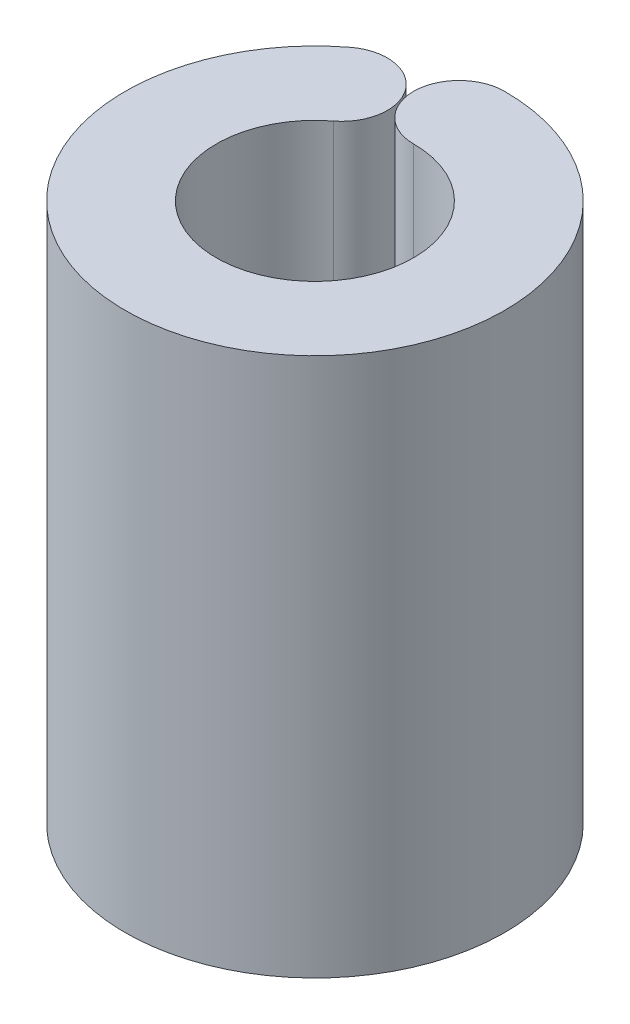
ISO-10303-21;
HEADER;
FILE_DESCRIPTION(('STEP AP214'),'2;1');
FILE_NAME('part.step','',(''),(''),'','','');
FILE_SCHEMA(('AUTOMOTIVE_DESIGN { 1 0 10303 214 1 1 1 1 }'));
ENDSEC;
DATA;
#1=APPLICATION_CONTEXT('core data for automotive mechanical design processes');
#2=APPLICATION_PROTOCOL_DEFINITION('international standard','automotive_design',2000,#1);
#3=PRODUCT_CONTEXT('',#1,'mechanical');
#4=PRODUCT('Part','Part','',(#3));
#5=PRODUCT_RELATED_PRODUCT_CATEGORY('part','',(#4));
#6=PRODUCT_DEFINITION_FORMATION('','',#4);
#7=PRODUCT_DEFINITION_CONTEXT('part definition',#1,'design');
#8=PRODUCT_DEFINITION('design','',#6,#7);
#9=PRODUCT_DEFINITION_SHAPE('','',#8);
#10=(LENGTH_UNIT() NAMED_UNIT(*) SI_UNIT(.MILLI.,.METRE.));
#11=(NAMED_UNIT(*) PLANE_ANGLE_UNIT() SI_UNIT($,.RADIAN.));
#12=(NAMED_UNIT(*) SI_UNIT($,.STERADIAN.) SOLID_ANGLE_UNIT());
#13=UNCERTAINTY_MEASURE_WITH_UNIT(LENGTH_MEASURE(1.E-05),#10,'distance_accuracy_value','');
#14=(GEOMETRIC_REPRESENTATION_CONTEXT(3) GLOBAL_UNCERTAINTY_ASSIGNED_CONTEXT((#13)) GLOBAL_UNIT_ASSIGNED_CONTEXT((#10,
#11,#12)) REPRESENTATION_CONTEXT('',''));
#15=CARTESIAN_POINT('',(0.,0.,0.));
#16=DIRECTION('',(0.,0.,1.));
#17=DIRECTION('',(1.,0.,0.));
#18=AXIS2_PLACEMENT_3D('',#15,#16,#17);
#19=CARTESIAN_POINT('',(0.,14.2,0.));
#20=DIRECTION('',(0.,-1.,0.));
#21=DIRECTION('',(0.,0.,-1.));
#22=AXIS2_PLACEMENT_3D('',#19,#20,#21);
#23=CYLINDRICAL_SURFACE('',#22,2.6);
#24=CARTESIAN_POINT('',(0.,0.,0.));
#25=DIRECTION('',(0.,1.,0.));
#26=DIRECTION('',(0.,0.,1.));
#27=AXIS2_PLACEMENT_3D('',#24,#25,#26);
#28=CIRCLE('',#27,2.6);
#29=CARTESIAN_POINT('',(0.,0.,-2.6));
#30=VERTEX_POINT('',#29);
#31=CARTESIAN_POINT('',(-1.57975097216721,0.,-2.06503919234884));
#32=VERTEX_POINT('',#31);
#33=EDGE_CURVE('E111',#30,#32,#28,.F.);
#34=ORIENTED_EDGE('',*,*,#33,.T.);
#35=DIRECTION('',(0.,-1.,0.));
#36=VECTOR('',#35,1.);
#37=CARTESIAN_POINT('',(-1.57975097216721,14.2,-2.06503919234884));
#38=LINE('',#37,#36);
#39=CARTESIAN_POINT('',(-1.57975097216721,14.2,-2.06503919234884));
#40=VERTEX_POINT('',#39);
#41=EDGE_CURVE('E11',#40,#32,#38,.T.);
#42=ORIENTED_EDGE('',*,*,#41,.F.);
#43=CARTESIAN_POINT('',(0.,14.2,0.));
#44=DIRECTION('',(0.,1.,0.));
#45=DIRECTION('',(0.,0.,1.));
#46=AXIS2_PLACEMENT_3D('',#43,#44,#45);
#47=CIRCLE('',#46,2.6);
#48=CARTESIAN_POINT('',(0.,14.2,-2.6));
#49=VERTEX_POINT('',#48);
#50=EDGE_CURVE('E93',#49,#40,#47,.F.);
#51=ORIENTED_EDGE('',*,*,#50,.F.);
#52=DIRECTION('',(0.,-1.,0.));
#53=VECTOR('',#52,1.);
#54=CARTESIAN_POINT('',(0.,14.2,-2.6));
#55=LINE('',#54,#53);
#56=EDGE_CURVE('E60',#49,#30,#55,.T.);
#57=ORIENTED_EDGE('',*,*,#56,.T.);
#58=EDGE_LOOP('',(#34,#42,#51,#57));
#59=FACE_BOUND('',#58,.T.);
#60=ADVANCED_FACE('F43',(#59),#23,.F.);
#61=CARTESIAN_POINT('',(-2.30886680547515,14.2,-3.01813420420216));
#62=DIRECTION('',(0.,-1.,0.));
#63=DIRECTION('',(0.,0.,-1.));
#64=AXIS2_PLACEMENT_3D('',#61,#62,#63);
#65=CYLINDRICAL_SURFACE('',#64,1.2);
#66=CARTESIAN_POINT('',(-2.30886680547515,0.,-3.01813420420216));
#67=DIRECTION('',(0.,1.,0.));
#68=DIRECTION('',(0.,0.,1.));
#69=AXIS2_PLACEMENT_3D('',#66,#67,#68);
#70=CIRCLE('',#69,1.2);
#71=CARTESIAN_POINT('',(-3.03798263878309,0.,-3.97122921605547));
#72=VERTEX_POINT('',#71);
#73=EDGE_CURVE('E99',#32,#72,#70,.T.);
#74=ORIENTED_EDGE('',*,*,#73,.T.);
#75=DIRECTION('',(0.,-1.,0.));
#76=VECTOR('',#75,1.);
#77=CARTESIAN_POINT('',(-3.03798263878309,14.2,-3.97122921605547));
#78=LINE('',#77,#76);
#79=CARTESIAN_POINT('',(-3.03798263878309,14.2,-3.97122921605547));
#80=VERTEX_POINT('',#79);
#81=EDGE_CURVE('E52',#80,#72,#78,.T.);
#82=ORIENTED_EDGE('',*,*,#81,.F.);
#83=CARTESIAN_POINT('',(-2.30886680547515,14.2,-3.01813420420216));
#84=DIRECTION('',(0.,1.,0.));
#85=DIRECTION('',(0.,0.,1.));
#86=AXIS2_PLACEMENT_3D('',#83,#84,#85);
#87=CIRCLE('',#86,1.2);
#88=EDGE_CURVE('E85',#40,#80,#87,.T.);
#89=ORIENTED_EDGE('',*,*,#88,.F.);
#90=ORIENTED_EDGE('',*,*,#41,.T.);
#91=EDGE_LOOP('',(#74,#82,#89,#90));
#92=FACE_BOUND('',#91,.T.);
#93=ADVANCED_FACE('F98',(#92),#65,.T.);
#94=CARTESIAN_POINT('',(0.,14.2,0.));
#95=DIRECTION('',(0.,-1.,0.));
#96=DIRECTION('',(0.,0.,-1.));
#97=AXIS2_PLACEMENT_3D('',#94,#95,#96);
#98=CYLINDRICAL_SURFACE('',#97,5.);
#99=CARTESIAN_POINT('',(0.,0.,0.));
#100=DIRECTION('',(0.,1.,0.));
#101=DIRECTION('',(0.,0.,1.));
#102=AXIS2_PLACEMENT_3D('',#99,#100,#101);
#103=CIRCLE('',#102,5.);
#104=CARTESIAN_POINT('',(0.,0.,-5.));
#105=VERTEX_POINT('',#104);
#106=EDGE_CURVE('E116',#105,#72,#103,.F.);
#107=ORIENTED_EDGE('',*,*,#106,.F.);
#108=DIRECTION('',(0.,-1.,0.));
#109=VECTOR('',#108,1.);
#110=CARTESIAN_POINT('',(0.,14.2,-5.));
#111=LINE('',#110,#109);
#112=CARTESIAN_POINT('',(0.,14.2,-5.));
#113=VERTEX_POINT('',#112);
#114=EDGE_CURVE('E74',#113,#105,#111,.T.);
#115=ORIENTED_EDGE('',*,*,#114,.F.);
#116=CARTESIAN_POINT('',(0.,14.2,0.));
#117=DIRECTION('',(0.,1.,0.));
#118=DIRECTION('',(0.,0.,1.));
#119=AXIS2_PLACEMENT_3D('',#116,#117,#118);
#120=CIRCLE('',#119,5.);
#121=EDGE_CURVE('E92',#113,#80,#120,.F.);
#122=ORIENTED_EDGE('',*,*,#121,.T.);
#123=ORIENTED_EDGE('',*,*,#81,.T.);
#124=EDGE_LOOP('',(#107,#115,#122,#123));
#125=FACE_BOUND('',#124,.T.);
#126=ADVANCED_FACE('F103',(#125),#98,.T.);
#127=CARTESIAN_POINT('',(0.,14.2,-3.8));
#128=DIRECTION('',(0.,-1.,0.));
#129=DIRECTION('',(0.,0.,-1.));
#130=AXIS2_PLACEMENT_3D('',#127,#128,#129);
#131=CYLINDRICAL_SURFACE('',#130,1.2);
#132=CARTESIAN_POINT('',(0.,0.,-3.8));
#133=DIRECTION('',(0.,1.,0.));
#134=DIRECTION('',(0.,0.,1.));
#135=AXIS2_PLACEMENT_3D('',#132,#133,#134);
#136=CIRCLE('',#135,1.2);
#137=EDGE_CURVE('E119',#30,#105,#136,.F.);
#138=ORIENTED_EDGE('',*,*,#137,.F.);
#139=ORIENTED_EDGE('',*,*,#56,.F.);
#140=CARTESIAN_POINT('',(0.,14.2,-3.8));
#141=DIRECTION('',(0.,1.,0.));
#142=DIRECTION('',(0.,0.,1.));
#143=AXIS2_PLACEMENT_3D('',#140,#141,#142);
#144=CIRCLE('',#143,1.2);
#145=EDGE_CURVE('E105',#49,#113,#144,.F.);
#146=ORIENTED_EDGE('',*,*,#145,.T.);
#147=ORIENTED_EDGE('',*,*,#114,.T.);
#148=EDGE_LOOP('',(#138,#139,#146,#147));
#149=FACE_BOUND('',#148,.T.);
#150=ADVANCED_FACE('F129',(#149),#131,.T.);
#151=CARTESIAN_POINT('',(0.,14.2,0.));
#152=DIRECTION('',(0.,1.,0.));
#153=DIRECTION('',(0.,0.,1.));
#154=AXIS2_PLACEMENT_3D('',#151,#152,#153);
#155=PLANE('',#154);
#156=ORIENTED_EDGE('',*,*,#50,.T.);
#157=ORIENTED_EDGE('',*,*,#88,.T.);
#158=ORIENTED_EDGE('',*,*,#121,.F.);
#159=ORIENTED_EDGE('',*,*,#145,.F.);
#160=EDGE_LOOP('',(#156,#157,#158,#159));
#161=FACE_BOUND('',#160,.T.);
#162=ADVANCED_FACE('F89',(#161),#155,.T.);
#163=CARTESIAN_POINT('',(0.,0.,0.));
#164=DIRECTION('',(0.,1.,0.));
#165=DIRECTION('',(0.,0.,1.));
#166=AXIS2_PLACEMENT_3D('',#163,#164,#165);
#167=PLANE('',#166);
#168=ORIENTED_EDGE('',*,*,#33,.F.);
#169=ORIENTED_EDGE('',*,*,#137,.T.);
#170=ORIENTED_EDGE('',*,*,#106,.T.);
#171=ORIENTED_EDGE('',*,*,#73,.F.);
#172=EDGE_LOOP('',(#168,#169,#170,#171));
#173=FACE_BOUND('',#172,.T.);
#174=ADVANCED_FACE('F128',(#173),#167,.F.);
#175=CLOSED_SHELL('',(#60,#93,#126,#150,#162,#174));
#176=MANIFOLD_SOLID_BREP('B2',#175);
#177=ADVANCED_BREP_SHAPE_REPRESENTATION('',(#18,#176),#14);
#178=SHAPE_DEFINITION_REPRESENTATION(#9,#177);
ENDSEC;
END-ISO-10303-21;
